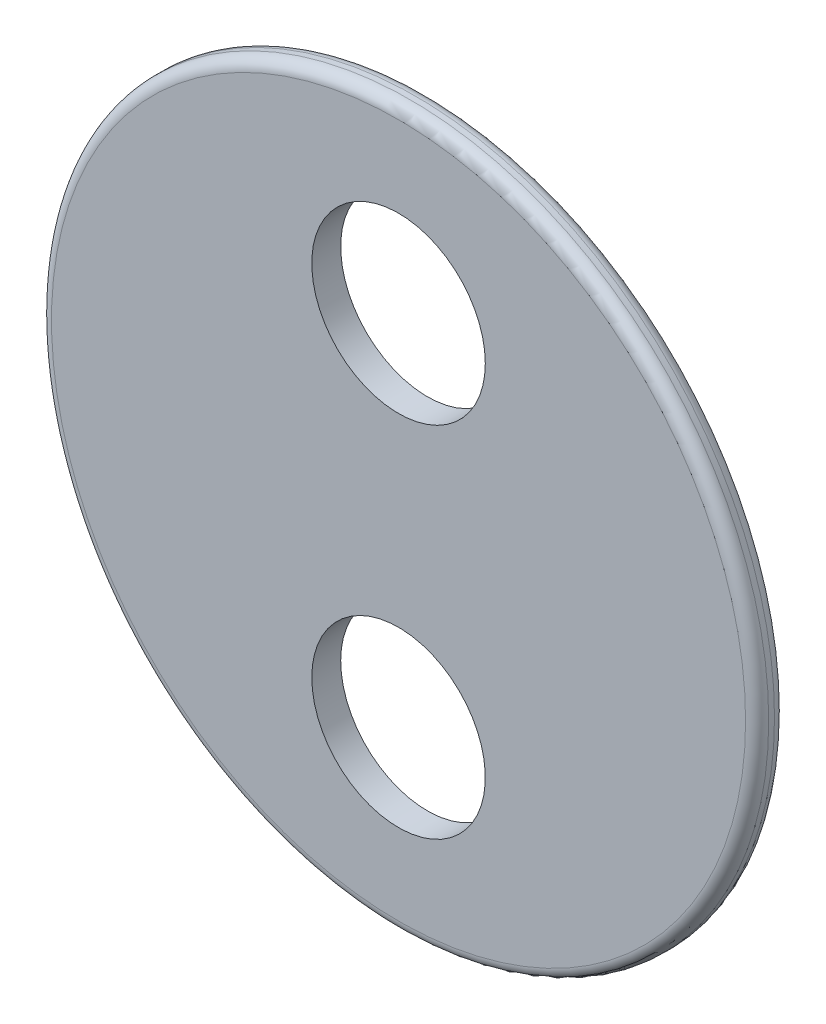
ISO-10303-21;
HEADER;
FILE_DESCRIPTION(('STEP AP214'),'2;1');
FILE_NAME('part.step','',(''),(''),'','','');
FILE_SCHEMA(('AUTOMOTIVE_DESIGN { 1 0 10303 214 1 1 1 1 }'));
ENDSEC;
DATA;
#1=APPLICATION_CONTEXT('core data for automotive mechanical design processes');
#2=APPLICATION_PROTOCOL_DEFINITION('international standard','automotive_design',2000,#1);
#3=PRODUCT_CONTEXT('',#1,'mechanical');
#4=PRODUCT('Part','Part','',(#3));
#5=PRODUCT_RELATED_PRODUCT_CATEGORY('part','',(#4));
#6=PRODUCT_DEFINITION_FORMATION('','',#4);
#7=PRODUCT_DEFINITION_CONTEXT('part definition',#1,'design');
#8=PRODUCT_DEFINITION('design','',#6,#7);
#9=PRODUCT_DEFINITION_SHAPE('','',#8);
#10=(LENGTH_UNIT() NAMED_UNIT(*) SI_UNIT(.MILLI.,.METRE.));
#11=(NAMED_UNIT(*) PLANE_ANGLE_UNIT() SI_UNIT($,.RADIAN.));
#12=(NAMED_UNIT(*) SI_UNIT($,.STERADIAN.) SOLID_ANGLE_UNIT());
#13=UNCERTAINTY_MEASURE_WITH_UNIT(LENGTH_MEASURE(1.E-05),#10,'distance_accuracy_value','');
#14=(GEOMETRIC_REPRESENTATION_CONTEXT(3) GLOBAL_UNCERTAINTY_ASSIGNED_CONTEXT((#13)) GLOBAL_UNIT_ASSIGNED_CONTEXT((#10,
#11,#12)) REPRESENTATION_CONTEXT('',''));
#15=CARTESIAN_POINT('',(0.,0.,0.));
#16=DIRECTION('',(0.,0.,1.));
#17=DIRECTION('',(1.,0.,0.));
#18=AXIS2_PLACEMENT_3D('',#15,#16,#17);
#19=CARTESIAN_POINT('',(0.,0.,3.175));
#20=DIRECTION('',(0.,0.,1.));
#21=DIRECTION('',(1.,0.,0.));
#22=AXIS2_PLACEMENT_3D('',#19,#20,#21);
#23=PLANE('',#22);
#24=CARTESIAN_POINT('',(0.,0.,3.175));
#25=DIRECTION('',(0.,0.,1.));
#26=DIRECTION('',(1.,0.,0.));
#27=AXIS2_PLACEMENT_3D('',#24,#25,#26);
#28=CIRCLE('',#27,38.1);
#29=CARTESIAN_POINT('',(38.1,0.,3.175));
#30=VERTEX_POINT('',#29);
#31=EDGE_CURVE('E10',#30,#30,#28,.T.);
#32=ORIENTED_EDGE('',*,*,#31,.T.);
#33=EDGE_LOOP('',(#32));
#34=FACE_BOUND('',#33,.T.);
#35=CARTESIAN_POINT('',(0.,19.685,3.175));
#36=DIRECTION('',(0.,0.,1.));
#37=DIRECTION('',(1.,0.,0.));
#38=AXIS2_PLACEMENT_3D('',#35,#36,#37);
#39=CIRCLE('',#38,9.525);
#40=CARTESIAN_POINT('',(9.525,19.685,3.175));
#41=VERTEX_POINT('',#40);
#42=EDGE_CURVE('E54',#41,#41,#39,.T.);
#43=ORIENTED_EDGE('',*,*,#42,.F.);
#44=EDGE_LOOP('',(#43));
#45=FACE_BOUND('',#44,.T.);
#46=CARTESIAN_POINT('',(0.,-19.685,3.175));
#47=DIRECTION('',(0.,0.,1.));
#48=DIRECTION('',(-1.,0.,0.));
#49=AXIS2_PLACEMENT_3D('',#46,#47,#48);
#50=CIRCLE('',#49,9.525);
#51=CARTESIAN_POINT('',(-9.525,-19.685,3.175));
#52=VERTEX_POINT('',#51);
#53=EDGE_CURVE('E58',#52,#52,#50,.T.);
#54=ORIENTED_EDGE('',*,*,#53,.F.);
#55=EDGE_LOOP('',(#54));
#56=FACE_BOUND('',#55,.T.);
#57=ADVANCED_FACE('F34',(#34,#45,#56),#23,.T.);
#58=CARTESIAN_POINT('',(0.,0.,0.));
#59=DIRECTION('',(0.,0.,1.));
#60=DIRECTION('',(1.,0.,0.));
#61=AXIS2_PLACEMENT_3D('',#58,#59,#60);
#62=PLANE('',#61);
#63=CARTESIAN_POINT('',(0.,0.,0.));
#64=DIRECTION('',(0.,0.,1.));
#65=DIRECTION('',(1.,0.,0.));
#66=AXIS2_PLACEMENT_3D('',#63,#64,#65);
#67=CIRCLE('',#66,38.1);
#68=CARTESIAN_POINT('',(38.1,0.,0.));
#69=VERTEX_POINT('',#68);
#70=EDGE_CURVE('E41',#69,#69,#67,.F.);
#71=ORIENTED_EDGE('',*,*,#70,.T.);
#72=EDGE_LOOP('',(#71));
#73=FACE_BOUND('',#72,.T.);
#74=CARTESIAN_POINT('',(0.,19.685,0.));
#75=DIRECTION('',(0.,0.,1.));
#76=DIRECTION('',(1.,0.,0.));
#77=AXIS2_PLACEMENT_3D('',#74,#75,#76);
#78=CIRCLE('',#77,9.525);
#79=CARTESIAN_POINT('',(9.525,19.685,0.));
#80=VERTEX_POINT('',#79);
#81=EDGE_CURVE('E55',#80,#80,#78,.T.);
#82=ORIENTED_EDGE('',*,*,#81,.T.);
#83=EDGE_LOOP('',(#82));
#84=FACE_BOUND('',#83,.T.);
#85=CARTESIAN_POINT('',(0.,-19.685,0.));
#86=DIRECTION('',(0.,0.,1.));
#87=DIRECTION('',(-1.,0.,0.));
#88=AXIS2_PLACEMENT_3D('',#85,#86,#87);
#89=CIRCLE('',#88,9.525);
#90=CARTESIAN_POINT('',(-9.525,-19.685,0.));
#91=VERTEX_POINT('',#90);
#92=EDGE_CURVE('E61',#91,#91,#89,.T.);
#93=ORIENTED_EDGE('',*,*,#92,.T.);
#94=EDGE_LOOP('',(#93));
#95=FACE_BOUND('',#94,.T.);
#96=ADVANCED_FACE('F71',(#73,#84,#95),#62,.F.);
#97=CARTESIAN_POINT('',(0.,0.,3.175));
#98=DIRECTION('',(0.,0.,-1.));
#99=DIRECTION('',(-1.,0.,0.));
#100=AXIS2_PLACEMENT_3D('',#97,#98,#99);
#101=CYLINDRICAL_SURFACE('',#100,39.37);
#102=CARTESIAN_POINT('',(0.,0.,1.27));
#103=DIRECTION('',(0.,0.,1.));
#104=DIRECTION('',(1.,0.,0.));
#105=AXIS2_PLACEMENT_3D('',#102,#103,#104);
#106=CIRCLE('',#105,39.37);
#107=CARTESIAN_POINT('',(39.37,0.,1.27));
#108=VERTEX_POINT('',#107);
#109=EDGE_CURVE('E45',#108,#108,#106,.T.);
#110=ORIENTED_EDGE('',*,*,#109,.T.);
#111=EDGE_LOOP('',(#110));
#112=FACE_BOUND('',#111,.T.);
#113=CARTESIAN_POINT('',(0.,0.,1.905));
#114=DIRECTION('',(0.,0.,1.));
#115=DIRECTION('',(1.,0.,0.));
#116=AXIS2_PLACEMENT_3D('',#113,#114,#115);
#117=CIRCLE('',#116,39.37);
#118=CARTESIAN_POINT('',(39.37,0.,1.905));
#119=VERTEX_POINT('',#118);
#120=EDGE_CURVE('E49',#119,#119,#117,.F.);
#121=ORIENTED_EDGE('',*,*,#120,.T.);
#122=EDGE_LOOP('',(#121));
#123=FACE_BOUND('',#122,.T.);
#124=ADVANCED_FACE('F76',(#112,#123),#101,.T.);
#125=CARTESIAN_POINT('',(0.,19.685,3.175));
#126=DIRECTION('',(0.,0.,-1.));
#127=DIRECTION('',(-1.,0.,0.));
#128=AXIS2_PLACEMENT_3D('',#125,#126,#127);
#129=CYLINDRICAL_SURFACE('',#128,9.525);
#130=ORIENTED_EDGE('',*,*,#42,.T.);
#131=EDGE_LOOP('',(#130));
#132=FACE_BOUND('',#131,.T.);
#133=ORIENTED_EDGE('',*,*,#81,.F.);
#134=EDGE_LOOP('',(#133));
#135=FACE_BOUND('',#134,.T.);
#136=ADVANCED_FACE('F80',(#132,#135),#129,.F.);
#137=CARTESIAN_POINT('',(0.,-19.685,3.175));
#138=DIRECTION('',(0.,0.,-1.));
#139=DIRECTION('',(-1.,0.,0.));
#140=AXIS2_PLACEMENT_3D('',#137,#138,#139);
#141=CYLINDRICAL_SURFACE('',#140,9.525);
#142=ORIENTED_EDGE('',*,*,#53,.T.);
#143=EDGE_LOOP('',(#142));
#144=FACE_BOUND('',#143,.T.);
#145=ORIENTED_EDGE('',*,*,#92,.F.);
#146=EDGE_LOOP('',(#145));
#147=FACE_BOUND('',#146,.T.);
#148=ADVANCED_FACE('F67',(#144,#147),#141,.F.);
#149=CARTESIAN_POINT('',(0.,0.,1.27));
#150=DIRECTION('',(0.,0.,1.));
#151=DIRECTION('',(1.,0.,0.));
#152=AXIS2_PLACEMENT_3D('',#149,#150,#151);
#153=TOROIDAL_SURFACE('',#152,38.1,1.27);
#154=ORIENTED_EDGE('',*,*,#70,.F.);
#155=EDGE_LOOP('',(#154));
#156=FACE_BOUND('',#155,.T.);
#157=ORIENTED_EDGE('',*,*,#109,.F.);
#158=EDGE_LOOP('',(#157));
#159=FACE_BOUND('',#158,.T.);
#160=ADVANCED_FACE('F85',(#156,#159),#153,.T.);
#161=CARTESIAN_POINT('',(0.,0.,1.905));
#162=DIRECTION('',(0.,0.,1.));
#163=DIRECTION('',(1.,0.,0.));
#164=AXIS2_PLACEMENT_3D('',#161,#162,#163);
#165=TOROIDAL_SURFACE('',#164,38.1,1.27);
#166=ORIENTED_EDGE('',*,*,#120,.F.);
#167=EDGE_LOOP('',(#166));
#168=FACE_BOUND('',#167,.T.);
#169=ORIENTED_EDGE('',*,*,#31,.F.);
#170=EDGE_LOOP('',(#169));
#171=FACE_BOUND('',#170,.T.);
#172=ADVANCED_FACE('F36',(#168,#171),#165,.T.);
#173=CLOSED_SHELL('',(#57,#96,#124,#136,#148,#160,#172));
#174=MANIFOLD_SOLID_BREP('B2',#173);
#175=ADVANCED_BREP_SHAPE_REPRESENTATION('',(#18,#174),#14);
#176=SHAPE_DEFINITION_REPRESENTATION(#9,#175);
ENDSEC;
END-ISO-10303-21;
